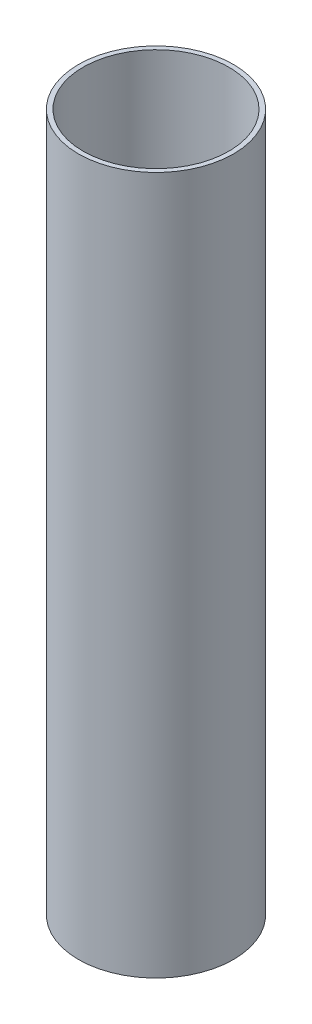
ISO-10303-21;
HEADER;
FILE_DESCRIPTION(('STEP AP214'),'2;1');
FILE_NAME('part.step','',(''),(''),'','','');
FILE_SCHEMA(('AUTOMOTIVE_DESIGN { 1 0 10303 214 1 1 1 1 }'));
ENDSEC;
DATA;
#1=APPLICATION_CONTEXT('core data for automotive mechanical design processes');
#2=APPLICATION_PROTOCOL_DEFINITION('international standard','automotive_design',2000,#1);
#3=PRODUCT_CONTEXT('',#1,'mechanical');
#4=PRODUCT('Part','Part','',(#3));
#5=PRODUCT_RELATED_PRODUCT_CATEGORY('part','',(#4));
#6=PRODUCT_DEFINITION_FORMATION('','',#4);
#7=PRODUCT_DEFINITION_CONTEXT('part definition',#1,'design');
#8=PRODUCT_DEFINITION('design','',#6,#7);
#9=PRODUCT_DEFINITION_SHAPE('','',#8);
#10=(LENGTH_UNIT() NAMED_UNIT(*) SI_UNIT(.MILLI.,.METRE.));
#11=(NAMED_UNIT(*) PLANE_ANGLE_UNIT() SI_UNIT($,.RADIAN.));
#12=(NAMED_UNIT(*) SI_UNIT($,.STERADIAN.) SOLID_ANGLE_UNIT());
#13=UNCERTAINTY_MEASURE_WITH_UNIT(LENGTH_MEASURE(1.E-05),#10,'distance_accuracy_value','');
#14=(GEOMETRIC_REPRESENTATION_CONTEXT(3) GLOBAL_UNCERTAINTY_ASSIGNED_CONTEXT((#13)) GLOBAL_UNIT_ASSIGNED_CONTEXT((#10,
#11,#12)) REPRESENTATION_CONTEXT('',''));
#15=CARTESIAN_POINT('',(0.,0.,0.));
#16=DIRECTION('',(0.,0.,1.));
#17=DIRECTION('',(1.,0.,0.));
#18=AXIS2_PLACEMENT_3D('',#15,#16,#17);
#19=CARTESIAN_POINT('',(0.,57.15,0.));
#20=DIRECTION('',(0.,1.,0.));
#21=DIRECTION('',(0.,0.,1.));
#22=AXIS2_PLACEMENT_3D('',#19,#20,#21);
#23=PLANE('',#22);
#24=CARTESIAN_POINT('',(0.,57.15,0.));
#25=DIRECTION('',(0.,1.,0.));
#26=DIRECTION('',(0.,0.,1.));
#27=AXIS2_PLACEMENT_3D('',#24,#25,#26);
#28=CIRCLE('',#27,6.35);
#29=CARTESIAN_POINT('',(0.,57.15,6.35));
#30=VERTEX_POINT('',#29);
#31=EDGE_CURVE('E10',#30,#30,#28,.T.);
#32=ORIENTED_EDGE('',*,*,#31,.T.);
#33=EDGE_LOOP('',(#32));
#34=FACE_BOUND('',#33,.T.);
#35=CARTESIAN_POINT('',(0.,57.15,0.));
#36=DIRECTION('',(0.,1.,0.));
#37=DIRECTION('',(0.,0.,1.));
#38=AXIS2_PLACEMENT_3D('',#35,#36,#37);
#39=CIRCLE('',#38,5.969);
#40=CARTESIAN_POINT('',(0.,57.15,5.969));
#41=VERTEX_POINT('',#40);
#42=EDGE_CURVE('E50',#41,#41,#39,.T.);
#43=ORIENTED_EDGE('',*,*,#42,.F.);
#44=EDGE_LOOP('',(#43));
#45=FACE_BOUND('',#44,.T.);
#46=ADVANCED_FACE('F37',(#34,#45),#23,.T.);
#47=CARTESIAN_POINT('',(0.,0.,0.));
#48=DIRECTION('',(0.,1.,0.));
#49=DIRECTION('',(0.,0.,1.));
#50=AXIS2_PLACEMENT_3D('',#47,#48,#49);
#51=PLANE('',#50);
#52=CARTESIAN_POINT('',(0.,0.,0.));
#53=DIRECTION('',(0.,1.,0.));
#54=DIRECTION('',(0.,0.,1.));
#55=AXIS2_PLACEMENT_3D('',#52,#53,#54);
#56=CIRCLE('',#55,6.35);
#57=CARTESIAN_POINT('',(0.,0.,6.35));
#58=VERTEX_POINT('',#57);
#59=EDGE_CURVE('E41',#58,#58,#56,.T.);
#60=ORIENTED_EDGE('',*,*,#59,.F.);
#61=EDGE_LOOP('',(#60));
#62=FACE_BOUND('',#61,.T.);
#63=CARTESIAN_POINT('',(0.,0.,0.));
#64=DIRECTION('',(0.,1.,0.));
#65=DIRECTION('',(0.,0.,1.));
#66=AXIS2_PLACEMENT_3D('',#63,#64,#65);
#67=CIRCLE('',#66,5.969);
#68=CARTESIAN_POINT('',(0.,0.,5.969));
#69=VERTEX_POINT('',#68);
#70=EDGE_CURVE('E52',#69,#69,#67,.T.);
#71=ORIENTED_EDGE('',*,*,#70,.T.);
#72=EDGE_LOOP('',(#71));
#73=FACE_BOUND('',#72,.T.);
#74=ADVANCED_FACE('F64',(#62,#73),#51,.F.);
#75=CARTESIAN_POINT('',(0.,57.15,0.));
#76=DIRECTION('',(0.,-1.,0.));
#77=DIRECTION('',(0.,0.,-1.));
#78=AXIS2_PLACEMENT_3D('',#75,#76,#77);
#79=CYLINDRICAL_SURFACE('',#78,6.35);
#80=ORIENTED_EDGE('',*,*,#31,.F.);
#81=EDGE_LOOP('',(#80));
#82=FACE_BOUND('',#81,.T.);
#83=ORIENTED_EDGE('',*,*,#59,.T.);
#84=EDGE_LOOP('',(#83));
#85=FACE_BOUND('',#84,.T.);
#86=ADVANCED_FACE('F39',(#82,#85),#79,.T.);
#87=CARTESIAN_POINT('',(0.,57.15,0.));
#88=DIRECTION('',(0.,-1.,0.));
#89=DIRECTION('',(0.,0.,-1.));
#90=AXIS2_PLACEMENT_3D('',#87,#88,#89);
#91=CYLINDRICAL_SURFACE('',#90,5.969);
#92=ORIENTED_EDGE('',*,*,#42,.T.);
#93=EDGE_LOOP('',(#92));
#94=FACE_BOUND('',#93,.T.);
#95=ORIENTED_EDGE('',*,*,#70,.F.);
#96=EDGE_LOOP('',(#95));
#97=FACE_BOUND('',#96,.T.);
#98=ADVANCED_FACE('F60',(#94,#97),#91,.F.);
#99=CLOSED_SHELL('',(#46,#74,#86,#98));
#100=MANIFOLD_SOLID_BREP('B2',#99);
#101=ADVANCED_BREP_SHAPE_REPRESENTATION('',(#18,#100),#14);
#102=SHAPE_DEFINITION_REPRESENTATION(#9,#101);
ENDSEC;
END-ISO-10303-21;
